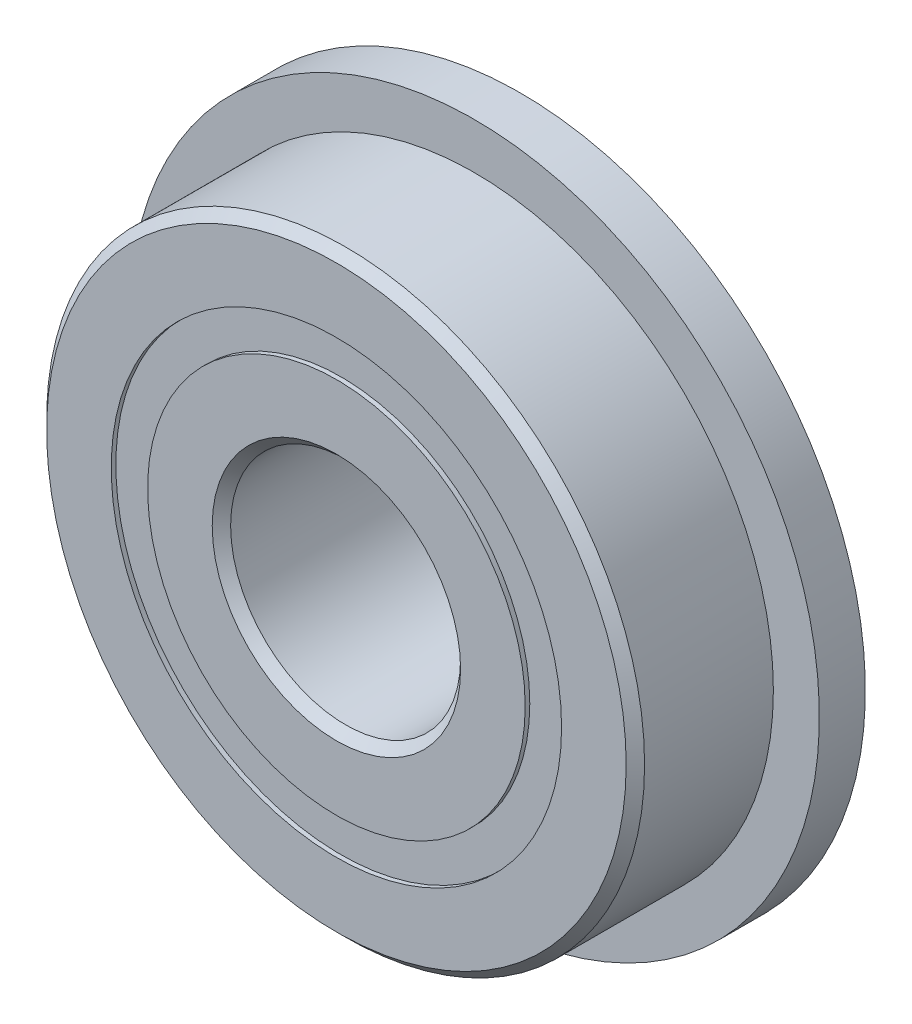
ISO-10303-21;
HEADER;
FILE_DESCRIPTION(('STEP AP214'),'2;1');
FILE_NAME('part.step','',(''),(''),'','','');
FILE_SCHEMA(('AUTOMOTIVE_DESIGN { 1 0 10303 214 1 1 1 1 }'));
ENDSEC;
DATA;
#1=APPLICATION_CONTEXT('core data for automotive mechanical design processes');
#2=APPLICATION_PROTOCOL_DEFINITION('international standard','automotive_design',2000,#1);
#3=PRODUCT_CONTEXT('',#1,'mechanical');
#4=PRODUCT('Part','Part','',(#3));
#5=PRODUCT_RELATED_PRODUCT_CATEGORY('part','',(#4));
#6=PRODUCT_DEFINITION_FORMATION('','',#4);
#7=PRODUCT_DEFINITION_CONTEXT('part definition',#1,'design');
#8=PRODUCT_DEFINITION('design','',#6,#7);
#9=PRODUCT_DEFINITION_SHAPE('','',#8);
#10=(LENGTH_UNIT() NAMED_UNIT(*) SI_UNIT(.MILLI.,.METRE.));
#11=(NAMED_UNIT(*) PLANE_ANGLE_UNIT() SI_UNIT($,.RADIAN.));
#12=(NAMED_UNIT(*) SI_UNIT($,.STERADIAN.) SOLID_ANGLE_UNIT());
#13=UNCERTAINTY_MEASURE_WITH_UNIT(LENGTH_MEASURE(1.E-05),#10,'distance_accuracy_value','');
#14=(GEOMETRIC_REPRESENTATION_CONTEXT(3) GLOBAL_UNCERTAINTY_ASSIGNED_CONTEXT((#13)) GLOBAL_UNIT_ASSIGNED_CONTEXT((#10,
#11,#12)) REPRESENTATION_CONTEXT('',''));
#15=CARTESIAN_POINT('',(0.,0.,0.));
#16=DIRECTION('',(0.,0.,1.));
#17=DIRECTION('',(1.,0.,0.));
#18=AXIS2_PLACEMENT_3D('',#15,#16,#17);
#19=CARTESIAN_POINT('',(0.,4.8956043956044,-1.9));
#20=DIRECTION('',(0.,0.,1.));
#21=DIRECTION('',(1.,0.,0.));
#22=AXIS2_PLACEMENT_3D('',#19,#20,#21);
#23=PLANE('',#22);
#24=CARTESIAN_POINT('',(0.,0.,-1.9));
#25=DIRECTION('',(0.,0.,1.));
#26=DIRECTION('',(1.,0.,0.));
#27=AXIS2_PLACEMENT_3D('',#24,#25,#26);
#28=CIRCLE('',#27,4.8956043956044);
#29=CARTESIAN_POINT('',(4.8956043956044,0.,-1.9));
#30=VERTEX_POINT('',#29);
#31=EDGE_CURVE('E57',#30,#30,#28,.T.);
#32=ORIENTED_EDGE('',*,*,#31,.F.);
#33=EDGE_LOOP('',(#32));
#34=FACE_BOUND('',#33,.T.);
#35=CARTESIAN_POINT('',(0.,0.,-1.9));
#36=DIRECTION('',(0.,0.,1.));
#37=DIRECTION('',(1.,0.,0.));
#38=AXIS2_PLACEMENT_3D('',#35,#36,#37);
#39=CIRCLE('',#38,4.1043956043956);
#40=CARTESIAN_POINT('',(4.1043956043956,0.,-1.9));
#41=VERTEX_POINT('',#40);
#42=EDGE_CURVE('E11',#41,#41,#39,.T.);
#43=ORIENTED_EDGE('',*,*,#42,.T.);
#44=EDGE_LOOP('',(#43));
#45=FACE_BOUND('',#44,.T.);
#46=ADVANCED_FACE('F43',(#34,#45),#23,.F.);
#47=CARTESIAN_POINT('',(0.,0.,2.));
#48=DIRECTION('',(0.,0.,1.));
#49=DIRECTION('',(1.,0.,0.));
#50=AXIS2_PLACEMENT_3D('',#47,#48,#49);
#51=CYLINDRICAL_SURFACE('',#50,4.1043956043956);
#52=ORIENTED_EDGE('',*,*,#42,.F.);
#53=EDGE_LOOP('',(#52));
#54=FACE_BOUND('',#53,.T.);
#55=CARTESIAN_POINT('',(0.,0.,-0.972947220876673));
#56=DIRECTION('',(0.,0.,1.));
#57=DIRECTION('',(1.,0.,0.));
#58=AXIS2_PLACEMENT_3D('',#55,#56,#57);
#59=CIRCLE('',#58,4.1043956043956);
#60=CARTESIAN_POINT('',(4.1043956043956,0.,-0.972947220876673));
#61=VERTEX_POINT('',#60);
#62=EDGE_CURVE('E49',#61,#61,#59,.T.);
#63=ORIENTED_EDGE('',*,*,#62,.T.);
#64=EDGE_LOOP('',(#63));
#65=FACE_BOUND('',#64,.T.);
#66=ADVANCED_FACE('F66',(#54,#65),#51,.F.);
#67=CARTESIAN_POINT('',(0.,4.8956043956044,-0.972947220876673));
#68=DIRECTION('',(0.,0.,-1.));
#69=DIRECTION('',(-1.,0.,0.));
#70=AXIS2_PLACEMENT_3D('',#67,#68,#69);
#71=PLANE('',#70);
#72=ORIENTED_EDGE('',*,*,#62,.F.);
#73=EDGE_LOOP('',(#72));
#74=FACE_BOUND('',#73,.T.);
#75=CARTESIAN_POINT('',(0.,0.,-0.972947220876673));
#76=DIRECTION('',(0.,0.,1.));
#77=DIRECTION('',(1.,0.,0.));
#78=AXIS2_PLACEMENT_3D('',#75,#76,#77);
#79=CIRCLE('',#78,4.8956043956044);
#80=CARTESIAN_POINT('',(4.8956043956044,0.,-0.972947220876673));
#81=VERTEX_POINT('',#80);
#82=EDGE_CURVE('E53',#81,#81,#79,.T.);
#83=ORIENTED_EDGE('',*,*,#82,.T.);
#84=EDGE_LOOP('',(#83));
#85=FACE_BOUND('',#84,.T.);
#86=ADVANCED_FACE('F70',(#74,#85),#71,.F.);
#87=CARTESIAN_POINT('',(0.,0.,2.));
#88=DIRECTION('',(0.,0.,1.));
#89=DIRECTION('',(1.,0.,0.));
#90=AXIS2_PLACEMENT_3D('',#87,#88,#89);
#91=CYLINDRICAL_SURFACE('',#90,4.8956043956044);
#92=ORIENTED_EDGE('',*,*,#82,.F.);
#93=EDGE_LOOP('',(#92));
#94=FACE_BOUND('',#93,.T.);
#95=ORIENTED_EDGE('',*,*,#31,.T.);
#96=EDGE_LOOP('',(#95));
#97=FACE_BOUND('',#96,.T.);
#98=ADVANCED_FACE('F63',(#94,#97),#91,.T.);
#99=CLOSED_SHELL('',(#46,#66,#86,#98));
#100=MANIFOLD_SOLID_BREP('B2',#99);
#101=CARTESIAN_POINT('',(0.,4.89560439560439,1.9));
#102=DIRECTION('',(0.,0.,-1.));
#103=DIRECTION('',(-1.,0.,0.));
#104=AXIS2_PLACEMENT_3D('',#101,#102,#103);
#105=PLANE('',#104);
#106=CARTESIAN_POINT('',(0.,0.,1.9));
#107=DIRECTION('',(0.,0.,1.));
#108=DIRECTION('',(1.,0.,0.));
#109=AXIS2_PLACEMENT_3D('',#106,#107,#108);
#110=CIRCLE('',#109,4.1043956043956);
#111=CARTESIAN_POINT('',(4.1043956043956,0.,1.9));
#112=VERTEX_POINT('',#111);
#113=EDGE_CURVE('E42',#112,#112,#110,.T.);
#114=ORIENTED_EDGE('',*,*,#113,.F.);
#115=EDGE_LOOP('',(#114));
#116=FACE_BOUND('',#115,.T.);
#117=CARTESIAN_POINT('',(0.,0.,1.9));
#118=DIRECTION('',(0.,0.,1.));
#119=DIRECTION('',(1.,0.,0.));
#120=AXIS2_PLACEMENT_3D('',#117,#118,#119);
#121=CIRCLE('',#120,4.89560439560439);
#122=CARTESIAN_POINT('',(4.89560439560439,0.,1.9));
#123=VERTEX_POINT('',#122);
#124=EDGE_CURVE('E124',#123,#123,#121,.T.);
#125=ORIENTED_EDGE('',*,*,#124,.T.);
#126=EDGE_LOOP('',(#125));
#127=FACE_BOUND('',#126,.T.);
#128=ADVANCED_FACE('F110',(#116,#127),#105,.F.);
#129=CARTESIAN_POINT('',(0.,0.,2.));
#130=DIRECTION('',(0.,0.,1.));
#131=DIRECTION('',(1.,0.,0.));
#132=AXIS2_PLACEMENT_3D('',#129,#130,#131);
#133=CYLINDRICAL_SURFACE('',#132,4.1043956043956);
#134=CARTESIAN_POINT('',(0.,0.,0.972947220876673));
#135=DIRECTION('',(0.,0.,1.));
#136=DIRECTION('',(1.,0.,0.));
#137=AXIS2_PLACEMENT_3D('',#134,#135,#136);
#138=CIRCLE('',#137,4.1043956043956);
#139=CARTESIAN_POINT('',(4.1043956043956,0.,0.972947220876673));
#140=VERTEX_POINT('',#139);
#141=EDGE_CURVE('E116',#140,#140,#138,.T.);
#142=ORIENTED_EDGE('',*,*,#141,.F.);
#143=EDGE_LOOP('',(#142));
#144=FACE_BOUND('',#143,.T.);
#145=ORIENTED_EDGE('',*,*,#113,.T.);
#146=EDGE_LOOP('',(#145));
#147=FACE_BOUND('',#146,.T.);
#148=ADVANCED_FACE('F139',(#144,#147),#133,.F.);
#149=CARTESIAN_POINT('',(0.,4.89560439560439,0.972947220876673));
#150=DIRECTION('',(0.,0.,1.));
#151=DIRECTION('',(1.,0.,0.));
#152=AXIS2_PLACEMENT_3D('',#149,#150,#151);
#153=PLANE('',#152);
#154=CARTESIAN_POINT('',(0.,0.,0.972947220876673));
#155=DIRECTION('',(0.,0.,1.));
#156=DIRECTION('',(1.,0.,0.));
#157=AXIS2_PLACEMENT_3D('',#154,#155,#156);
#158=CIRCLE('',#157,4.89560439560439);
#159=CARTESIAN_POINT('',(4.89560439560439,0.,0.972947220876673));
#160=VERTEX_POINT('',#159);
#161=EDGE_CURVE('E120',#160,#160,#158,.T.);
#162=ORIENTED_EDGE('',*,*,#161,.F.);
#163=EDGE_LOOP('',(#162));
#164=FACE_BOUND('',#163,.T.);
#165=ORIENTED_EDGE('',*,*,#141,.T.);
#166=EDGE_LOOP('',(#165));
#167=FACE_BOUND('',#166,.T.);
#168=ADVANCED_FACE('F134',(#164,#167),#153,.F.);
#169=CARTESIAN_POINT('',(0.,0.,2.));
#170=DIRECTION('',(0.,0.,1.));
#171=DIRECTION('',(1.,0.,0.));
#172=AXIS2_PLACEMENT_3D('',#169,#170,#171);
#173=CYLINDRICAL_SURFACE('',#172,4.89560439560439);
#174=ORIENTED_EDGE('',*,*,#124,.F.);
#175=EDGE_LOOP('',(#174));
#176=FACE_BOUND('',#175,.T.);
#177=ORIENTED_EDGE('',*,*,#161,.T.);
#178=EDGE_LOOP('',(#177));
#179=FACE_BOUND('',#178,.T.);
#180=ADVANCED_FACE('F131',(#176,#179),#173,.T.);
#181=CLOSED_SHELL('',(#128,#148,#168,#180));
#182=MANIFOLD_SOLID_BREP('B6',#181);
#183=CARTESIAN_POINT('',(-2.24999999999995,3.89711431703,0.));
#184=DIRECTION('',(0.,0.,1.));
#185=DIRECTION('',(-0.499999999999989,0.866025403784445,0.));
#186=AXIS2_PLACEMENT_3D('',#183,#184,#185);
#187=SPHERICAL_SURFACE('',#186,0.972947220876673);
#188=CARTESIAN_POINT('',(-2.24999999999995,3.89711431703,0.972947220876673));
#189=VERTEX_POINT('',#188);
#190=VERTEX_LOOP('',#189);
#191=FACE_BOUND('',#190,.T.);
#192=ADVANCED_FACE('F177',(#191),#187,.T.);
#193=CLOSED_SHELL('',(#192));
#194=MANIFOLD_SOLID_BREP('B37',#193);
#195=CARTESIAN_POINT('',(-3.89711431702995,2.25000000000005,0.));
#196=DIRECTION('',(0.,0.,1.));
#197=DIRECTION('',(-0.866025403784433,0.50000000000001,0.));
#198=AXIS2_PLACEMENT_3D('',#195,#196,#197);
#199=SPHERICAL_SURFACE('',#198,0.972947220876673);
#200=CARTESIAN_POINT('',(-3.89711431702995,2.25000000000005,0.972947220876673));
#201=VERTEX_POINT('',#200);
#202=VERTEX_LOOP('',#201);
#203=FACE_BOUND('',#202,.T.);
#204=ADVANCED_FACE('F197',(#203),#199,.T.);
#205=CLOSED_SHELL('',(#204));
#206=MANIFOLD_SOLID_BREP('B106',#205);
#207=CARTESIAN_POINT('',(-4.5,0.,0.));
#208=DIRECTION('',(0.,0.,1.));
#209=DIRECTION('',(-1.,0.,0.));
#210=AXIS2_PLACEMENT_3D('',#207,#208,#209);
#211=SPHERICAL_SURFACE('',#210,0.972947220876673);
#212=CARTESIAN_POINT('',(-4.5,0.,0.972947220876673));
#213=VERTEX_POINT('',#212);
#214=VERTEX_LOOP('',#213);
#215=FACE_BOUND('',#214,.T.);
#216=ADVANCED_FACE('F217',(#215),#211,.T.);
#217=CLOSED_SHELL('',(#216));
#218=MANIFOLD_SOLID_BREP('B173',#217);
#219=CARTESIAN_POINT('',(-3.89711431702999,-2.24999999999996,0.));
#220=DIRECTION('',(0.,0.,1.));
#221=DIRECTION('',(-0.866025403784443,-0.499999999999992,0.));
#222=AXIS2_PLACEMENT_3D('',#219,#220,#221);
#223=SPHERICAL_SURFACE('',#222,0.972947220876673);
#224=CARTESIAN_POINT('',(-3.89711431702999,-2.24999999999996,0.972947220876673));
#225=VERTEX_POINT('',#224);
#226=VERTEX_LOOP('',#225);
#227=FACE_BOUND('',#226,.T.);
#228=ADVANCED_FACE('F237',(#227),#223,.T.);
#229=CLOSED_SHELL('',(#228));
#230=MANIFOLD_SOLID_BREP('B193',#229);
#231=CARTESIAN_POINT('',(-2.25000000000003,-3.89711431702996,0.));
#232=DIRECTION('',(0.,0.,1.));
#233=DIRECTION('',(-0.500000000000007,-0.866025403784435,0.));
#234=AXIS2_PLACEMENT_3D('',#231,#232,#233);
#235=SPHERICAL_SURFACE('',#234,0.972947220876673);
#236=CARTESIAN_POINT('',(-2.25000000000003,-3.89711431702996,0.972947220876673));
#237=VERTEX_POINT('',#236);
#238=VERTEX_LOOP('',#237);
#239=FACE_BOUND('',#238,.T.);
#240=ADVANCED_FACE('F257',(#239),#235,.T.);
#241=CLOSED_SHELL('',(#240));
#242=MANIFOLD_SOLID_BREP('B213',#241);
#243=CARTESIAN_POINT('',(0.,-4.5,0.));
#244=DIRECTION('',(0.,0.,1.));
#245=DIRECTION('',(0.,-1.,0.));
#246=AXIS2_PLACEMENT_3D('',#243,#244,#245);
#247=SPHERICAL_SURFACE('',#246,0.972947220876673);
#248=CARTESIAN_POINT('',(0.,-4.5,0.972947220876673));
#249=VERTEX_POINT('',#248);
#250=VERTEX_LOOP('',#249);
#251=FACE_BOUND('',#250,.T.);
#252=ADVANCED_FACE('F277',(#251),#247,.T.);
#253=CLOSED_SHELL('',(#252));
#254=MANIFOLD_SOLID_BREP('B233',#253);
#255=CARTESIAN_POINT('',(2.24999999999998,-3.89711431702999,0.));
#256=DIRECTION('',(0.,0.,1.));
#257=DIRECTION('',(0.499999999999995,-0.866025403784442,0.));
#258=AXIS2_PLACEMENT_3D('',#255,#256,#257);
#259=SPHERICAL_SURFACE('',#258,0.972947220876673);
#260=CARTESIAN_POINT('',(2.24999999999998,-3.89711431702999,0.972947220876673));
#261=VERTEX_POINT('',#260);
#262=VERTEX_LOOP('',#261);
#263=FACE_BOUND('',#262,.T.);
#264=ADVANCED_FACE('F297',(#263),#259,.T.);
#265=CLOSED_SHELL('',(#264));
#266=MANIFOLD_SOLID_BREP('B253',#265);
#267=CARTESIAN_POINT('',(3.89711431702996,-2.25000000000002,0.));
#268=DIRECTION('',(0.,0.,1.));
#269=DIRECTION('',(0.866025403784436,-0.500000000000004,0.));
#270=AXIS2_PLACEMENT_3D('',#267,#268,#269);
#271=SPHERICAL_SURFACE('',#270,0.972947220876673);
#272=CARTESIAN_POINT('',(3.89711431702996,-2.25000000000002,0.972947220876673));
#273=VERTEX_POINT('',#272);
#274=VERTEX_LOOP('',#273);
#275=FACE_BOUND('',#274,.T.);
#276=ADVANCED_FACE('F317',(#275),#271,.T.);
#277=CLOSED_SHELL('',(#276));
#278=MANIFOLD_SOLID_BREP('B273',#277);
#279=CARTESIAN_POINT('',(4.5,0.,0.));
#280=DIRECTION('',(0.,0.,1.));
#281=DIRECTION('',(1.,0.,0.));
#282=AXIS2_PLACEMENT_3D('',#279,#280,#281);
#283=SPHERICAL_SURFACE('',#282,0.972947220876673);
#284=CARTESIAN_POINT('',(4.5,0.,0.972947220876673));
#285=VERTEX_POINT('',#284);
#286=VERTEX_LOOP('',#285);
#287=FACE_BOUND('',#286,.T.);
#288=ADVANCED_FACE('F337',(#287),#283,.T.);
#289=CLOSED_SHELL('',(#288));
#290=MANIFOLD_SOLID_BREP('B293',#289);
#291=CARTESIAN_POINT('',(3.89711431702998,2.24999999999999,0.));
#292=DIRECTION('',(0.,0.,1.));
#293=DIRECTION('',(0.86602540378444,0.499999999999998,0.));
#294=AXIS2_PLACEMENT_3D('',#291,#292,#293);
#295=SPHERICAL_SURFACE('',#294,0.972947220876673);
#296=CARTESIAN_POINT('',(3.89711431702998,2.24999999999999,0.972947220876673));
#297=VERTEX_POINT('',#296);
#298=VERTEX_LOOP('',#297);
#299=FACE_BOUND('',#298,.T.);
#300=ADVANCED_FACE('F357',(#299),#295,.T.);
#301=CLOSED_SHELL('',(#300));
#302=MANIFOLD_SOLID_BREP('B313',#301);
#303=CARTESIAN_POINT('',(2.25,3.89711431702997,0.));
#304=DIRECTION('',(0.,0.,1.));
#305=DIRECTION('',(0.500000000000001,0.866025403784438,0.));
#306=AXIS2_PLACEMENT_3D('',#303,#304,#305);
#307=SPHERICAL_SURFACE('',#306,0.972947220876673);
#308=CARTESIAN_POINT('',(2.25,3.89711431702997,0.972947220876673));
#309=VERTEX_POINT('',#308);
#310=VERTEX_LOOP('',#309);
#311=FACE_BOUND('',#310,.T.);
#312=ADVANCED_FACE('F377',(#311),#307,.T.);
#313=CLOSED_SHELL('',(#312));
#314=MANIFOLD_SOLID_BREP('B333',#313);
#315=CARTESIAN_POINT('',(0.,4.5,0.));
#316=DIRECTION('',(0.,0.,1.));
#317=DIRECTION('',(0.,1.,0.));
#318=AXIS2_PLACEMENT_3D('',#315,#316,#317);
#319=SPHERICAL_SURFACE('',#318,0.972947220876673);
#320=CARTESIAN_POINT('',(0.,4.5,0.972947220876673));
#321=VERTEX_POINT('',#320);
#322=VERTEX_LOOP('',#321);
#323=FACE_BOUND('',#322,.T.);
#324=ADVANCED_FACE('F399',(#323),#319,.T.);
#325=CLOSED_SHELL('',(#324));
#326=MANIFOLD_SOLID_BREP('B353',#325);
#327=CARTESIAN_POINT('',(0.,4.1043956043956,2.));
#328=DIRECTION('',(0.,0.,-1.));
#329=DIRECTION('',(-1.,0.,0.));
#330=AXIS2_PLACEMENT_3D('',#327,#328,#329);
#331=PLANE('',#330);
#332=CARTESIAN_POINT('',(0.,0.,2.));
#333=DIRECTION('',(0.,0.,1.));
#334=DIRECTION('',(1.,0.,0.));
#335=AXIS2_PLACEMENT_3D('',#332,#333,#334);
#336=CIRCLE('',#335,2.7);
#337=CARTESIAN_POINT('',(2.7,0.,2.));
#338=VERTEX_POINT('',#337);
#339=EDGE_CURVE('E446',#338,#338,#336,.T.);
#340=ORIENTED_EDGE('',*,*,#339,.F.);
#341=EDGE_LOOP('',(#340));
#342=FACE_BOUND('',#341,.T.);
#343=CARTESIAN_POINT('',(0.,0.,2.));
#344=DIRECTION('',(0.,0.,1.));
#345=DIRECTION('',(1.,0.,0.));
#346=AXIS2_PLACEMENT_3D('',#343,#344,#345);
#347=CIRCLE('',#346,4.1043956043956);
#348=CARTESIAN_POINT('',(4.1043956043956,0.,2.));
#349=VERTEX_POINT('',#348);
#350=EDGE_CURVE('E398',#349,#349,#347,.T.);
#351=ORIENTED_EDGE('',*,*,#350,.T.);
#352=EDGE_LOOP('',(#351));
#353=FACE_BOUND('',#352,.T.);
#354=ADVANCED_FACE('F418',(#342,#353),#331,.F.);
#355=CARTESIAN_POINT('',(0.,0.,2.));
#356=DIRECTION('',(0.,0.,1.));
#357=DIRECTION('',(1.,0.,0.));
#358=AXIS2_PLACEMENT_3D('',#355,#356,#357);
#359=CYLINDRICAL_SURFACE('',#358,4.1043956043956);
#360=ORIENTED_EDGE('',*,*,#350,.F.);
#361=EDGE_LOOP('',(#360));
#362=FACE_BOUND('',#361,.T.);
#363=CARTESIAN_POINT('',(0.,0.,0.888888888888889));
#364=DIRECTION('',(0.,0.,1.));
#365=DIRECTION('',(1.,0.,0.));
#366=AXIS2_PLACEMENT_3D('',#363,#364,#365);
#367=CIRCLE('',#366,4.1043956043956);
#368=CARTESIAN_POINT('',(4.1043956043956,0.,0.888888888888889));
#369=VERTEX_POINT('',#368);
#370=EDGE_CURVE('E424',#369,#369,#367,.T.);
#371=ORIENTED_EDGE('',*,*,#370,.T.);
#372=EDGE_LOOP('',(#371));
#373=FACE_BOUND('',#372,.T.);
#374=ADVANCED_FACE('F453',(#362,#373),#359,.T.);
#375=CARTESIAN_POINT('',(0.,0.,0.));
#376=DIRECTION('',(0.,0.,1.));
#377=DIRECTION('',(1.,0.,0.));
#378=AXIS2_PLACEMENT_3D('',#375,#376,#377);
#379=TOROIDAL_SURFACE('',#378,4.5,0.972947220876672);
#380=ORIENTED_EDGE('',*,*,#370,.F.);
#381=EDGE_LOOP('',(#380));
#382=FACE_BOUND('',#381,.T.);
#383=CARTESIAN_POINT('',(0.,0.,-0.88888888888889));
#384=DIRECTION('',(0.,0.,1.));
#385=DIRECTION('',(1.,0.,0.));
#386=AXIS2_PLACEMENT_3D('',#383,#384,#385);
#387=CIRCLE('',#386,4.1043956043956);
#388=CARTESIAN_POINT('',(4.1043956043956,0.,-0.88888888888889));
#389=VERTEX_POINT('',#388);
#390=EDGE_CURVE('E428',#389,#389,#387,.T.);
#391=ORIENTED_EDGE('',*,*,#390,.T.);
#392=EDGE_LOOP('',(#391));
#393=FACE_BOUND('',#392,.T.);
#394=ADVANCED_FACE('F457',(#382,#393),#379,.F.);
#395=CARTESIAN_POINT('',(0.,0.,2.));
#396=DIRECTION('',(0.,0.,1.));
#397=DIRECTION('',(1.,0.,0.));
#398=AXIS2_PLACEMENT_3D('',#395,#396,#397);
#399=CYLINDRICAL_SURFACE('',#398,4.1043956043956);
#400=ORIENTED_EDGE('',*,*,#390,.F.);
#401=EDGE_LOOP('',(#400));
#402=FACE_BOUND('',#401,.T.);
#403=CARTESIAN_POINT('',(0.,0.,-2.));
#404=DIRECTION('',(0.,0.,1.));
#405=DIRECTION('',(1.,0.,0.));
#406=AXIS2_PLACEMENT_3D('',#403,#404,#405);
#407=CIRCLE('',#406,4.1043956043956);
#408=CARTESIAN_POINT('',(4.1043956043956,0.,-2.));
#409=VERTEX_POINT('',#408);
#410=EDGE_CURVE('E432',#409,#409,#407,.T.);
#411=ORIENTED_EDGE('',*,*,#410,.T.);
#412=EDGE_LOOP('',(#411));
#413=FACE_BOUND('',#412,.T.);
#414=ADVANCED_FACE('F462',(#402,#413),#399,.T.);
#415=CARTESIAN_POINT('',(0.,2.7,-2.));
#416=DIRECTION('',(0.,0.,1.));
#417=DIRECTION('',(1.,0.,0.));
#418=AXIS2_PLACEMENT_3D('',#415,#416,#417);
#419=PLANE('',#418);
#420=ORIENTED_EDGE('',*,*,#410,.F.);
#421=EDGE_LOOP('',(#420));
#422=FACE_BOUND('',#421,.T.);
#423=CARTESIAN_POINT('',(0.,0.,-2.));
#424=DIRECTION('',(0.,0.,1.));
#425=DIRECTION('',(1.,0.,0.));
#426=AXIS2_PLACEMENT_3D('',#423,#424,#425);
#427=CIRCLE('',#426,2.7);
#428=CARTESIAN_POINT('',(2.7,0.,-2.));
#429=VERTEX_POINT('',#428);
#430=EDGE_CURVE('E437',#429,#429,#427,.T.);
#431=ORIENTED_EDGE('',*,*,#430,.T.);
#432=EDGE_LOOP('',(#431));
#433=FACE_BOUND('',#432,.T.);
#434=ADVANCED_FACE('F468',(#422,#433),#419,.F.);
#435=CARTESIAN_POINT('',(0.,0.,-1.8));
#436=DIRECTION('',(0.,0.,-1.));
#437=DIRECTION('',(-1.,0.,0.));
#438=AXIS2_PLACEMENT_3D('',#435,#436,#437);
#439=CONICAL_SURFACE('',#438,2.5,0.785398163397444);
#440=ORIENTED_EDGE('',*,*,#430,.F.);
#441=EDGE_LOOP('',(#440));
#442=FACE_BOUND('',#441,.T.);
#443=CARTESIAN_POINT('',(0.,0.,-1.8));
#444=DIRECTION('',(0.,0.,1.));
#445=DIRECTION('',(1.,0.,0.));
#446=AXIS2_PLACEMENT_3D('',#443,#444,#445);
#447=CIRCLE('',#446,2.5);
#448=CARTESIAN_POINT('',(2.5,0.,-1.8));
#449=VERTEX_POINT('',#448);
#450=EDGE_CURVE('E440',#449,#449,#447,.T.);
#451=ORIENTED_EDGE('',*,*,#450,.T.);
#452=EDGE_LOOP('',(#451));
#453=FACE_BOUND('',#452,.T.);
#454=ADVANCED_FACE('F472',(#442,#453),#439,.F.);
#455=CARTESIAN_POINT('',(0.,0.,2.));
#456=DIRECTION('',(0.,0.,1.));
#457=DIRECTION('',(1.,0.,0.));
#458=AXIS2_PLACEMENT_3D('',#455,#456,#457);
#459=CYLINDRICAL_SURFACE('',#458,2.5);
#460=ORIENTED_EDGE('',*,*,#450,.F.);
#461=EDGE_LOOP('',(#460));
#462=FACE_BOUND('',#461,.T.);
#463=CARTESIAN_POINT('',(0.,0.,1.8));
#464=DIRECTION('',(0.,0.,1.));
#465=DIRECTION('',(1.,0.,0.));
#466=AXIS2_PLACEMENT_3D('',#463,#464,#465);
#467=CIRCLE('',#466,2.5);
#468=CARTESIAN_POINT('',(2.5,0.,1.8));
#469=VERTEX_POINT('',#468);
#470=EDGE_CURVE('E443',#469,#469,#467,.T.);
#471=ORIENTED_EDGE('',*,*,#470,.T.);
#472=EDGE_LOOP('',(#471));
#473=FACE_BOUND('',#472,.T.);
#474=ADVANCED_FACE('F476',(#462,#473),#459,.F.);
#475=CARTESIAN_POINT('',(0.,0.,2.));
#476=DIRECTION('',(0.,0.,1.));
#477=DIRECTION('',(1.,0.,0.));
#478=AXIS2_PLACEMENT_3D('',#475,#476,#477);
#479=CONICAL_SURFACE('',#478,2.7,0.785398163397451);
#480=ORIENTED_EDGE('',*,*,#470,.F.);
#481=EDGE_LOOP('',(#480));
#482=FACE_BOUND('',#481,.T.);
#483=ORIENTED_EDGE('',*,*,#339,.T.);
#484=EDGE_LOOP('',(#483));
#485=FACE_BOUND('',#484,.T.);
#486=ADVANCED_FACE('F450',(#482,#485),#479,.F.);
#487=CLOSED_SHELL('',(#354,#374,#394,#414,#434,#454,#474,#486));
#488=MANIFOLD_SOLID_BREP('B373',#487);
#489=CARTESIAN_POINT('',(0.,0.,1.8));
#490=DIRECTION('',(0.,0.,-1.));
#491=DIRECTION('',(-1.,0.,0.));
#492=AXIS2_PLACEMENT_3D('',#489,#490,#491);
#493=CONICAL_SURFACE('',#492,6.5,0.785398163397447);
#494=CARTESIAN_POINT('',(0.,0.,2.));
#495=DIRECTION('',(0.,0.,1.));
#496=DIRECTION('',(1.,0.,0.));
#497=AXIS2_PLACEMENT_3D('',#494,#495,#496);
#498=CIRCLE('',#497,6.3);
#499=CARTESIAN_POINT('',(6.3,0.,2.));
#500=VERTEX_POINT('',#499);
#501=EDGE_CURVE('E561',#500,#500,#498,.T.);
#502=ORIENTED_EDGE('',*,*,#501,.F.);
#503=EDGE_LOOP('',(#502));
#504=FACE_BOUND('',#503,.T.);
#505=CARTESIAN_POINT('',(0.,0.,1.8));
#506=DIRECTION('',(0.,0.,1.));
#507=DIRECTION('',(1.,0.,0.));
#508=AXIS2_PLACEMENT_3D('',#505,#506,#507);
#509=CIRCLE('',#508,6.5);
#510=CARTESIAN_POINT('',(6.5,0.,1.8));
#511=VERTEX_POINT('',#510);
#512=EDGE_CURVE('E417',#511,#511,#509,.T.);
#513=ORIENTED_EDGE('',*,*,#512,.T.);
#514=EDGE_LOOP('',(#513));
#515=FACE_BOUND('',#514,.T.);
#516=ADVANCED_FACE('F539',(#504,#515),#493,.T.);
#517=CARTESIAN_POINT('',(0.,0.,2.));
#518=DIRECTION('',(0.,0.,1.));
#519=DIRECTION('',(1.,0.,0.));
#520=AXIS2_PLACEMENT_3D('',#517,#518,#519);
#521=CYLINDRICAL_SURFACE('',#520,6.5);
#522=CARTESIAN_POINT('',(0.,0.,-1.));
#523=DIRECTION('',(0.,0.,1.));
#524=DIRECTION('',(1.,0.,0.));
#525=AXIS2_PLACEMENT_3D('',#522,#523,#524);
#526=CIRCLE('',#525,6.5);
#527=CARTESIAN_POINT('',(6.5,0.,-1.));
#528=VERTEX_POINT('',#527);
#529=EDGE_CURVE('E564',#528,#528,#526,.T.);
#530=ORIENTED_EDGE('',*,*,#529,.T.);
#531=EDGE_LOOP('',(#530));
#532=FACE_BOUND('',#531,.T.);
#533=ORIENTED_EDGE('',*,*,#512,.F.);
#534=EDGE_LOOP('',(#533));
#535=FACE_BOUND('',#534,.T.);
#536=ADVANCED_FACE('F584',(#532,#535),#521,.T.);
#537=CARTESIAN_POINT('',(0.,6.3,-2.));
#538=DIRECTION('',(0.,0.,1.));
#539=DIRECTION('',(1.,0.,0.));
#540=AXIS2_PLACEMENT_3D('',#537,#538,#539);
#541=PLANE('',#540);
#542=CARTESIAN_POINT('',(0.,0.,-2.));
#543=DIRECTION('',(0.,0.,1.));
#544=DIRECTION('',(1.,0.,0.));
#545=AXIS2_PLACEMENT_3D('',#542,#543,#544);
#546=CIRCLE('',#545,4.8956043956044);
#547=CARTESIAN_POINT('',(4.8956043956044,0.,-2.));
#548=VERTEX_POINT('',#547);
#549=EDGE_CURVE('E545',#548,#548,#546,.T.);
#550=ORIENTED_EDGE('',*,*,#549,.T.);
#551=EDGE_LOOP('',(#550));
#552=FACE_BOUND('',#551,.T.);
#553=CARTESIAN_POINT('',(0.,0.,-2.));
#554=DIRECTION('',(0.,0.,-1.));
#555=DIRECTION('',(-1.,0.,0.));
#556=AXIS2_PLACEMENT_3D('',#553,#554,#555);
#557=CIRCLE('',#556,7.5);
#558=CARTESIAN_POINT('',(-7.5,0.,-2.));
#559=VERTEX_POINT('',#558);
#560=EDGE_CURVE('E567',#559,#559,#557,.T.);
#561=ORIENTED_EDGE('',*,*,#560,.T.);
#562=EDGE_LOOP('',(#561));
#563=FACE_BOUND('',#562,.T.);
#564=ADVANCED_FACE('F587',(#552,#563),#541,.F.);
#565=CARTESIAN_POINT('',(0.,0.,2.));
#566=DIRECTION('',(0.,0.,1.));
#567=DIRECTION('',(1.,0.,0.));
#568=AXIS2_PLACEMENT_3D('',#565,#566,#567);
#569=CYLINDRICAL_SURFACE('',#568,4.89560439560439);
#570=CARTESIAN_POINT('',(0.,0.,-0.888888888888889));
#571=DIRECTION('',(0.,0.,1.));
#572=DIRECTION('',(1.,0.,0.));
#573=AXIS2_PLACEMENT_3D('',#570,#571,#572);
#574=CIRCLE('',#573,4.89560439560439);
#575=CARTESIAN_POINT('',(4.89560439560439,0.,-0.888888888888889));
#576=VERTEX_POINT('',#575);
#577=EDGE_CURVE('E549',#576,#576,#574,.T.);
#578=ORIENTED_EDGE('',*,*,#577,.T.);
#579=EDGE_LOOP('',(#578));
#580=FACE_BOUND('',#579,.T.);
#581=ORIENTED_EDGE('',*,*,#549,.F.);
#582=EDGE_LOOP('',(#581));
#583=FACE_BOUND('',#582,.T.);
#584=ADVANCED_FACE('F592',(#580,#583),#569,.F.);
#585=CARTESIAN_POINT('',(0.,0.,0.));
#586=DIRECTION('',(0.,0.,1.));
#587=DIRECTION('',(1.,0.,0.));
#588=AXIS2_PLACEMENT_3D('',#585,#586,#587);
#589=TOROIDAL_SURFACE('',#588,4.5,0.972947220876673);
#590=ORIENTED_EDGE('',*,*,#577,.F.);
#591=EDGE_LOOP('',(#590));
#592=FACE_BOUND('',#591,.T.);
#593=CARTESIAN_POINT('',(0.,0.,0.888888888888889));
#594=DIRECTION('',(0.,0.,1.));
#595=DIRECTION('',(1.,0.,0.));
#596=AXIS2_PLACEMENT_3D('',#593,#594,#595);
#597=CIRCLE('',#596,4.89560439560439);
#598=CARTESIAN_POINT('',(4.89560439560439,0.,0.888888888888889));
#599=VERTEX_POINT('',#598);
#600=EDGE_CURVE('E553',#599,#599,#597,.T.);
#601=ORIENTED_EDGE('',*,*,#600,.T.);
#602=EDGE_LOOP('',(#601));
#603=FACE_BOUND('',#602,.T.);
#604=ADVANCED_FACE('F598',(#592,#603),#589,.F.);
#605=CARTESIAN_POINT('',(0.,0.,2.));
#606=DIRECTION('',(0.,0.,1.));
#607=DIRECTION('',(1.,0.,0.));
#608=AXIS2_PLACEMENT_3D('',#605,#606,#607);
#609=CYLINDRICAL_SURFACE('',#608,4.89560439560439);
#610=ORIENTED_EDGE('',*,*,#600,.F.);
#611=EDGE_LOOP('',(#610));
#612=FACE_BOUND('',#611,.T.);
#613=CARTESIAN_POINT('',(0.,0.,2.));
#614=DIRECTION('',(0.,0.,1.));
#615=DIRECTION('',(1.,0.,0.));
#616=AXIS2_PLACEMENT_3D('',#613,#614,#615);
#617=CIRCLE('',#616,4.89560439560439);
#618=CARTESIAN_POINT('',(4.89560439560439,0.,2.));
#619=VERTEX_POINT('',#618);
#620=EDGE_CURVE('E558',#619,#619,#617,.T.);
#621=ORIENTED_EDGE('',*,*,#620,.T.);
#622=EDGE_LOOP('',(#621));
#623=FACE_BOUND('',#622,.T.);
#624=ADVANCED_FACE('F602',(#612,#623),#609,.F.);
#625=CARTESIAN_POINT('',(0.,6.3,2.));
#626=DIRECTION('',(0.,0.,-1.));
#627=DIRECTION('',(-1.,0.,0.));
#628=AXIS2_PLACEMENT_3D('',#625,#626,#627);
#629=PLANE('',#628);
#630=ORIENTED_EDGE('',*,*,#620,.F.);
#631=EDGE_LOOP('',(#630));
#632=FACE_BOUND('',#631,.T.);
#633=ORIENTED_EDGE('',*,*,#501,.T.);
#634=EDGE_LOOP('',(#633));
#635=FACE_BOUND('',#634,.T.);
#636=ADVANCED_FACE('F580',(#632,#635),#629,.F.);
#637=CARTESIAN_POINT('',(0.,4.8956043956044,-1.));
#638=DIRECTION('',(0.,0.,1.));
#639=DIRECTION('',(1.,0.,0.));
#640=AXIS2_PLACEMENT_3D('',#637,#638,#639);
#641=PLANE('',#640);
#642=CARTESIAN_POINT('',(0.,0.,-1.));
#643=DIRECTION('',(0.,0.,-1.));
#644=DIRECTION('',(-1.,0.,0.));
#645=AXIS2_PLACEMENT_3D('',#642,#643,#644);
#646=CIRCLE('',#645,7.5);
#647=CARTESIAN_POINT('',(-7.5,0.,-1.));
#648=VERTEX_POINT('',#647);
#649=EDGE_CURVE('E570',#648,#648,#646,.T.);
#650=ORIENTED_EDGE('',*,*,#649,.F.);
#651=EDGE_LOOP('',(#650));
#652=FACE_BOUND('',#651,.T.);
#653=ORIENTED_EDGE('',*,*,#529,.F.);
#654=EDGE_LOOP('',(#653));
#655=FACE_BOUND('',#654,.T.);
#656=ADVANCED_FACE('F577',(#652,#655),#641,.T.);
#657=CARTESIAN_POINT('',(0.,0.,-2.));
#658=DIRECTION('',(0.,0.,-1.));
#659=DIRECTION('',(-1.,0.,0.));
#660=AXIS2_PLACEMENT_3D('',#657,#658,#659);
#661=CYLINDRICAL_SURFACE('',#660,7.5);
#662=ORIENTED_EDGE('',*,*,#649,.T.);
#663=EDGE_LOOP('',(#662));
#664=FACE_BOUND('',#663,.T.);
#665=ORIENTED_EDGE('',*,*,#560,.F.);
#666=EDGE_LOOP('',(#665));
#667=FACE_BOUND('',#666,.T.);
#668=ADVANCED_FACE('F574',(#664,#667),#661,.T.);
#669=CLOSED_SHELL('',(#516,#536,#564,#584,#604,#624,#636,#656,#668));
#670=MANIFOLD_SOLID_BREP('B393',#669);
#671=ADVANCED_BREP_SHAPE_REPRESENTATION('',(#18,#100,#182,#194,#206,#218,#230,#242,#254,#266,
#278,#290,#302,#314,#326,#488,#670),#14);
#672=SHAPE_DEFINITION_REPRESENTATION(#9,#671);
ENDSEC;
END-ISO-10303-21;
